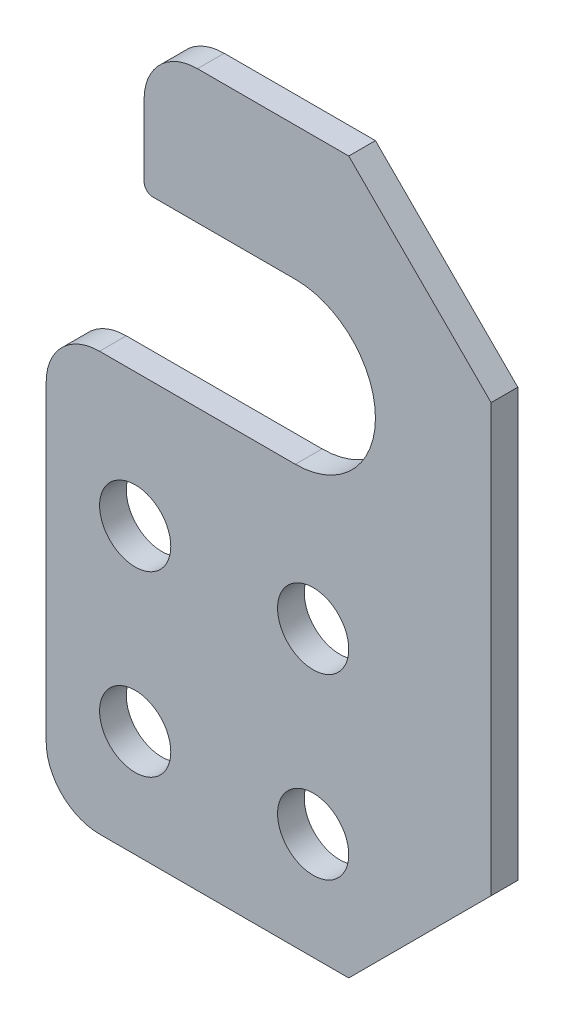
ISO-10303-21;
HEADER;
FILE_DESCRIPTION(('STEP AP214'),'2;1');
FILE_NAME('part.step','',(''),(''),'','','');
FILE_SCHEMA(('AUTOMOTIVE_DESIGN { 1 0 10303 214 1 1 1 1 }'));
ENDSEC;
DATA;
#1=APPLICATION_CONTEXT('core data for automotive mechanical design processes');
#2=APPLICATION_PROTOCOL_DEFINITION('international standard','automotive_design',2000,#1);
#3=PRODUCT_CONTEXT('',#1,'mechanical');
#4=PRODUCT('Part','Part','',(#3));
#5=PRODUCT_RELATED_PRODUCT_CATEGORY('part','',(#4));
#6=PRODUCT_DEFINITION_FORMATION('','',#4);
#7=PRODUCT_DEFINITION_CONTEXT('part definition',#1,'design');
#8=PRODUCT_DEFINITION('design','',#6,#7);
#9=PRODUCT_DEFINITION_SHAPE('','',#8);
#10=(LENGTH_UNIT() NAMED_UNIT(*) SI_UNIT(.MILLI.,.METRE.));
#11=(NAMED_UNIT(*) PLANE_ANGLE_UNIT() SI_UNIT($,.RADIAN.));
#12=(NAMED_UNIT(*) SI_UNIT($,.STERADIAN.) SOLID_ANGLE_UNIT());
#13=UNCERTAINTY_MEASURE_WITH_UNIT(LENGTH_MEASURE(1.E-05),#10,'distance_accuracy_value','');
#14=(GEOMETRIC_REPRESENTATION_CONTEXT(3) GLOBAL_UNCERTAINTY_ASSIGNED_CONTEXT((#13)) GLOBAL_UNIT_ASSIGNED_CONTEXT((#10,
#11,#12)) REPRESENTATION_CONTEXT('',''));
#15=CARTESIAN_POINT('',(0.,0.,0.));
#16=DIRECTION('',(0.,0.,1.));
#17=DIRECTION('',(1.,0.,0.));
#18=AXIS2_PLACEMENT_3D('',#15,#16,#17);
#19=CARTESIAN_POINT('',(0.,0.,1.5));
#20=DIRECTION('',(0.,0.,1.));
#21=DIRECTION('',(1.,0.,0.));
#22=AXIS2_PLACEMENT_3D('',#19,#20,#21);
#23=PLANE('',#22);
#24=DIRECTION('',(0.,1.,0.));
#25=VECTOR('',#24,1.);
#26=CARTESIAN_POINT('',(10.5,0.,1.5));
#27=LINE('',#26,#25);
#28=CARTESIAN_POINT('',(10.5,-7.,1.5));
#29=VERTEX_POINT('',#28);
#30=CARTESIAN_POINT('',(10.5,-3.,1.5));
#31=VERTEX_POINT('',#30);
#32=EDGE_CURVE('E152',#29,#31,#27,.T.);
#33=ORIENTED_EDGE('',*,*,#32,.F.);
#34=CARTESIAN_POINT('',(11.,-7.,1.5));
#35=DIRECTION('',(0.,0.,1.));
#36=DIRECTION('',(1.,0.,0.));
#37=AXIS2_PLACEMENT_3D('',#34,#35,#36);
#38=CIRCLE('',#37,0.5);
#39=CARTESIAN_POINT('',(11.,-7.5,1.5));
#40=VERTEX_POINT('',#39);
#41=EDGE_CURVE('E54',#29,#40,#38,.T.);
#42=ORIENTED_EDGE('',*,*,#41,.T.);
#43=DIRECTION('',(-1.,0.,0.));
#44=VECTOR('',#43,1.);
#45=CARTESIAN_POINT('',(10.5,-7.5,1.5));
#46=LINE('',#45,#44);
#47=CARTESIAN_POINT('',(19.,-7.5,1.5));
#48=VERTEX_POINT('',#47);
#49=EDGE_CURVE('E155',#48,#40,#46,.T.);
#50=ORIENTED_EDGE('',*,*,#49,.F.);
#51=CARTESIAN_POINT('',(19.,-12.,1.5));
#52=DIRECTION('',(0.,0.,1.));
#53=DIRECTION('',(1.,0.,0.));
#54=AXIS2_PLACEMENT_3D('',#51,#52,#53);
#55=CIRCLE('',#54,4.5);
#56=CARTESIAN_POINT('',(19.,-16.5,1.5));
#57=VERTEX_POINT('',#56);
#58=EDGE_CURVE('E141',#57,#48,#55,.T.);
#59=ORIENTED_EDGE('',*,*,#58,.F.);
#60=DIRECTION('',(1.,0.,0.));
#61=VECTOR('',#60,1.);
#62=CARTESIAN_POINT('',(5.,-16.5,1.5));
#63=LINE('',#62,#61);
#64=CARTESIAN_POINT('',(8.,-16.5,1.5));
#65=VERTEX_POINT('',#64);
#66=EDGE_CURVE('E133',#65,#57,#63,.T.);
#67=ORIENTED_EDGE('',*,*,#66,.F.);
#68=CARTESIAN_POINT('',(8.,-19.5,1.5));
#69=DIRECTION('',(0.,0.,1.));
#70=DIRECTION('',(1.,0.,0.));
#71=AXIS2_PLACEMENT_3D('',#68,#69,#70);
#72=CIRCLE('',#71,3.);
#73=CARTESIAN_POINT('',(5.,-19.5,1.5));
#74=VERTEX_POINT('',#73);
#75=EDGE_CURVE('E248',#65,#74,#72,.T.);
#76=ORIENTED_EDGE('',*,*,#75,.T.);
#77=DIRECTION('',(0.,1.,0.));
#78=VECTOR('',#77,1.);
#79=CARTESIAN_POINT('',(5.,-16.5,1.5));
#80=LINE('',#79,#78);
#81=CARTESIAN_POINT('',(5.,-37.,1.5));
#82=VERTEX_POINT('',#81);
#83=EDGE_CURVE('E142',#82,#74,#80,.T.);
#84=ORIENTED_EDGE('',*,*,#83,.F.);
#85=CARTESIAN_POINT('',(8.,-37.,1.5));
#86=DIRECTION('',(0.,0.,1.));
#87=DIRECTION('',(1.,0.,0.));
#88=AXIS2_PLACEMENT_3D('',#85,#86,#87);
#89=CIRCLE('',#88,3.);
#90=CARTESIAN_POINT('',(8.,-40.,1.5));
#91=VERTEX_POINT('',#90);
#92=EDGE_CURVE('E250',#82,#91,#89,.T.);
#93=ORIENTED_EDGE('',*,*,#92,.T.);
#94=DIRECTION('',(1.,0.,0.));
#95=VECTOR('',#94,1.);
#96=CARTESIAN_POINT('',(0.,-40.,1.5));
#97=LINE('',#96,#95);
#98=CARTESIAN_POINT('',(21.9999999999999,-40.,1.5));
#99=VERTEX_POINT('',#98);
#100=EDGE_CURVE('E192',#91,#99,#97,.T.);
#101=ORIENTED_EDGE('',*,*,#100,.T.);
#102=DIRECTION('',(-0.707106781186549,-0.707106781186546,0.));
#103=VECTOR('',#102,1.);
#104=CARTESIAN_POINT('',(30.9999999999999,-31.,1.5));
#105=LINE('',#104,#103);
#106=CARTESIAN_POINT('',(30.,-32.,1.5));
#107=VERTEX_POINT('',#106);
#108=EDGE_CURVE('E222',#99,#107,#105,.F.);
#109=ORIENTED_EDGE('',*,*,#108,.T.);
#110=DIRECTION('',(0.,1.,0.));
#111=VECTOR('',#110,1.);
#112=CARTESIAN_POINT('',(30.,0.,1.5));
#113=LINE('',#112,#111);
#114=CARTESIAN_POINT('',(30.,-8.00000000000002,1.5));
#115=VERTEX_POINT('',#114);
#116=EDGE_CURVE('E194',#107,#115,#113,.T.);
#117=ORIENTED_EDGE('',*,*,#116,.T.);
#118=DIRECTION('',(0.707106781186546,-0.707106781186549,0.));
#119=VECTOR('',#118,1.);
#120=CARTESIAN_POINT('',(11.,11.,1.5));
#121=LINE('',#120,#119);
#122=CARTESIAN_POINT('',(22.,0.,1.5));
#123=VERTEX_POINT('',#122);
#124=EDGE_CURVE('E220',#115,#123,#121,.F.);
#125=ORIENTED_EDGE('',*,*,#124,.T.);
#126=DIRECTION('',(-1.,0.,0.));
#127=VECTOR('',#126,1.);
#128=CARTESIAN_POINT('',(0.,0.,1.5));
#129=LINE('',#128,#127);
#130=CARTESIAN_POINT('',(13.5,0.,1.5));
#131=VERTEX_POINT('',#130);
#132=EDGE_CURVE('E198',#123,#131,#129,.T.);
#133=ORIENTED_EDGE('',*,*,#132,.T.);
#134=CARTESIAN_POINT('',(13.5,-3.,1.5));
#135=DIRECTION('',(0.,0.,1.));
#136=DIRECTION('',(1.,0.,0.));
#137=AXIS2_PLACEMENT_3D('',#134,#135,#136);
#138=CIRCLE('',#137,3.);
#139=EDGE_CURVE('E245',#131,#31,#138,.T.);
#140=ORIENTED_EDGE('',*,*,#139,.T.);
#141=EDGE_LOOP('',(#33,#42,#50,#59,#67,#76,#84,#93,#101,#109,#117,#125,#133,#140));
#142=FACE_BOUND('',#141,.T.);
#143=CARTESIAN_POINT('',(20.,-24.,1.5));
#144=DIRECTION('',(0.,0.,1.));
#145=DIRECTION('',(1.,0.,0.));
#146=AXIS2_PLACEMENT_3D('',#143,#144,#145);
#147=CIRCLE('',#146,2.);
#148=CARTESIAN_POINT('',(22.,-24.,1.5));
#149=VERTEX_POINT('',#148);
#150=EDGE_CURVE('E174',#149,#149,#147,.T.);
#151=ORIENTED_EDGE('',*,*,#150,.F.);
#152=EDGE_LOOP('',(#151));
#153=FACE_BOUND('',#152,.T.);
#154=CARTESIAN_POINT('',(20.,-34.,1.5));
#155=DIRECTION('',(0.,0.,1.));
#156=DIRECTION('',(1.,0.,0.));
#157=AXIS2_PLACEMENT_3D('',#154,#155,#156);
#158=CIRCLE('',#157,2.00000000000001);
#159=CARTESIAN_POINT('',(22.,-34.,1.5));
#160=VERTEX_POINT('',#159);
#161=EDGE_CURVE('E186',#160,#160,#158,.T.);
#162=ORIENTED_EDGE('',*,*,#161,.F.);
#163=EDGE_LOOP('',(#162));
#164=FACE_BOUND('',#163,.T.);
#165=CARTESIAN_POINT('',(10.,-34.,1.5));
#166=DIRECTION('',(0.,0.,1.));
#167=DIRECTION('',(1.,0.,0.));
#168=AXIS2_PLACEMENT_3D('',#165,#166,#167);
#169=CIRCLE('',#168,2.);
#170=CARTESIAN_POINT('',(12.,-34.,1.5));
#171=VERTEX_POINT('',#170);
#172=EDGE_CURVE('E180',#171,#171,#169,.T.);
#173=ORIENTED_EDGE('',*,*,#172,.F.);
#174=EDGE_LOOP('',(#173));
#175=FACE_BOUND('',#174,.T.);
#176=CARTESIAN_POINT('',(10.,-24.,1.5));
#177=DIRECTION('',(0.,0.,1.));
#178=DIRECTION('',(1.,0.,0.));
#179=AXIS2_PLACEMENT_3D('',#176,#177,#178);
#180=CIRCLE('',#179,2.);
#181=CARTESIAN_POINT('',(12.,-24.,1.5));
#182=VERTEX_POINT('',#181);
#183=EDGE_CURVE('E168',#182,#182,#180,.T.);
#184=ORIENTED_EDGE('',*,*,#183,.F.);
#185=EDGE_LOOP('',(#184));
#186=FACE_BOUND('',#185,.T.);
#187=ADVANCED_FACE('F32',(#142,#153,#164,#175,#186),#23,.T.);
#188=CARTESIAN_POINT('',(0.,0.,0.));
#189=DIRECTION('',(0.,0.,1.));
#190=DIRECTION('',(1.,0.,0.));
#191=AXIS2_PLACEMENT_3D('',#188,#189,#190);
#192=PLANE('',#191);
#193=DIRECTION('',(-1.,0.,0.));
#194=VECTOR('',#193,1.);
#195=CARTESIAN_POINT('',(0.,-7.5,0.));
#196=LINE('',#195,#194);
#197=CARTESIAN_POINT('',(19.,-7.5,0.));
#198=VERTEX_POINT('',#197);
#199=CARTESIAN_POINT('',(11.,-7.5,0.));
#200=VERTEX_POINT('',#199);
#201=EDGE_CURVE('E230',#198,#200,#196,.T.);
#202=ORIENTED_EDGE('',*,*,#201,.T.);
#203=CARTESIAN_POINT('',(11.,-7.,0.));
#204=DIRECTION('',(0.,0.,1.));
#205=DIRECTION('',(1.,0.,0.));
#206=AXIS2_PLACEMENT_3D('',#203,#204,#205);
#207=CIRCLE('',#206,0.5);
#208=CARTESIAN_POINT('',(10.5,-7.,0.));
#209=VERTEX_POINT('',#208);
#210=EDGE_CURVE('E11',#200,#209,#207,.F.);
#211=ORIENTED_EDGE('',*,*,#210,.T.);
#212=DIRECTION('',(0.,1.,0.));
#213=VECTOR('',#212,1.);
#214=CARTESIAN_POINT('',(10.5,0.,0.));
#215=LINE('',#214,#213);
#216=CARTESIAN_POINT('',(10.5,-3.,0.));
#217=VERTEX_POINT('',#216);
#218=EDGE_CURVE('E161',#209,#217,#215,.T.);
#219=ORIENTED_EDGE('',*,*,#218,.T.);
#220=CARTESIAN_POINT('',(13.5,-3.,0.));
#221=DIRECTION('',(0.,0.,1.));
#222=DIRECTION('',(1.,0.,0.));
#223=AXIS2_PLACEMENT_3D('',#220,#221,#222);
#224=CIRCLE('',#223,3.);
#225=CARTESIAN_POINT('',(13.5,0.,0.));
#226=VERTEX_POINT('',#225);
#227=EDGE_CURVE('E235',#217,#226,#224,.F.);
#228=ORIENTED_EDGE('',*,*,#227,.T.);
#229=DIRECTION('',(-1.,0.,0.));
#230=VECTOR('',#229,1.);
#231=CARTESIAN_POINT('',(0.,0.,0.));
#232=LINE('',#231,#230);
#233=CARTESIAN_POINT('',(22.,0.,0.));
#234=VERTEX_POINT('',#233);
#235=EDGE_CURVE('E195',#234,#226,#232,.T.);
#236=ORIENTED_EDGE('',*,*,#235,.F.);
#237=DIRECTION('',(-0.707106781186546,0.707106781186549,0.));
#238=VECTOR('',#237,1.);
#239=CARTESIAN_POINT('',(22.,0.,0.));
#240=LINE('',#239,#238);
#241=CARTESIAN_POINT('',(30.,-8.00000000000002,0.));
#242=VERTEX_POINT('',#241);
#243=EDGE_CURVE('E212',#234,#242,#240,.F.);
#244=ORIENTED_EDGE('',*,*,#243,.T.);
#245=DIRECTION('',(0.,1.,0.));
#246=VECTOR('',#245,1.);
#247=CARTESIAN_POINT('',(30.,0.,0.));
#248=LINE('',#247,#246);
#249=CARTESIAN_POINT('',(30.,-32.,0.));
#250=VERTEX_POINT('',#249);
#251=EDGE_CURVE('E203',#250,#242,#248,.T.);
#252=ORIENTED_EDGE('',*,*,#251,.F.);
#253=DIRECTION('',(0.707106781186549,0.707106781186546,0.));
#254=VECTOR('',#253,1.);
#255=CARTESIAN_POINT('',(30.,-32.,0.));
#256=LINE('',#255,#254);
#257=CARTESIAN_POINT('',(21.9999999999999,-40.,0.));
#258=VERTEX_POINT('',#257);
#259=EDGE_CURVE('E214',#250,#258,#256,.F.);
#260=ORIENTED_EDGE('',*,*,#259,.T.);
#261=DIRECTION('',(1.,0.,0.));
#262=VECTOR('',#261,1.);
#263=CARTESIAN_POINT('',(0.,-40.,0.));
#264=LINE('',#263,#262);
#265=CARTESIAN_POINT('',(8.,-40.,0.));
#266=VERTEX_POINT('',#265);
#267=EDGE_CURVE('E189',#266,#258,#264,.T.);
#268=ORIENTED_EDGE('',*,*,#267,.F.);
#269=CARTESIAN_POINT('',(8.,-37.,0.));
#270=DIRECTION('',(0.,0.,1.));
#271=DIRECTION('',(1.,0.,0.));
#272=AXIS2_PLACEMENT_3D('',#269,#270,#271);
#273=CIRCLE('',#272,3.);
#274=CARTESIAN_POINT('',(5.,-37.,0.));
#275=VERTEX_POINT('',#274);
#276=EDGE_CURVE('E239',#266,#275,#273,.F.);
#277=ORIENTED_EDGE('',*,*,#276,.T.);
#278=DIRECTION('',(0.,1.,0.));
#279=VECTOR('',#278,1.);
#280=CARTESIAN_POINT('',(5.,0.,0.));
#281=LINE('',#280,#279);
#282=CARTESIAN_POINT('',(5.,-19.5,0.));
#283=VERTEX_POINT('',#282);
#284=EDGE_CURVE('E164',#275,#283,#281,.T.);
#285=ORIENTED_EDGE('',*,*,#284,.T.);
#286=CARTESIAN_POINT('',(8.,-19.5,0.));
#287=DIRECTION('',(0.,0.,1.));
#288=DIRECTION('',(1.,0.,0.));
#289=AXIS2_PLACEMENT_3D('',#286,#287,#288);
#290=CIRCLE('',#289,3.);
#291=CARTESIAN_POINT('',(8.,-16.5,0.));
#292=VERTEX_POINT('',#291);
#293=EDGE_CURVE('E237',#283,#292,#290,.F.);
#294=ORIENTED_EDGE('',*,*,#293,.T.);
#295=DIRECTION('',(1.,0.,0.));
#296=VECTOR('',#295,1.);
#297=CARTESIAN_POINT('',(0.,-16.5,0.));
#298=LINE('',#297,#296);
#299=CARTESIAN_POINT('',(19.,-16.5,0.));
#300=VERTEX_POINT('',#299);
#301=EDGE_CURVE('E227',#292,#300,#298,.T.);
#302=ORIENTED_EDGE('',*,*,#301,.T.);
#303=CARTESIAN_POINT('',(19.,-12.,0.));
#304=DIRECTION('',(0.,0.,1.));
#305=DIRECTION('',(1.,0.,0.));
#306=AXIS2_PLACEMENT_3D('',#303,#304,#305);
#307=CIRCLE('',#306,4.5);
#308=EDGE_CURVE('E150',#300,#198,#307,.T.);
#309=ORIENTED_EDGE('',*,*,#308,.T.);
#310=EDGE_LOOP('',(#202,#211,#219,#228,#236,#244,#252,#260,#268,#277,#285,#294,#302,#309));
#311=FACE_BOUND('',#310,.T.);
#312=CARTESIAN_POINT('',(20.,-34.,0.));
#313=DIRECTION('',(0.,0.,1.));
#314=DIRECTION('',(1.,0.,0.));
#315=AXIS2_PLACEMENT_3D('',#312,#313,#314);
#316=CIRCLE('',#315,2.00000000000001);
#317=CARTESIAN_POINT('',(22.,-34.,0.));
#318=VERTEX_POINT('',#317);
#319=EDGE_CURVE('E183',#318,#318,#316,.T.);
#320=ORIENTED_EDGE('',*,*,#319,.T.);
#321=EDGE_LOOP('',(#320));
#322=FACE_BOUND('',#321,.T.);
#323=CARTESIAN_POINT('',(10.,-34.,0.));
#324=DIRECTION('',(0.,0.,1.));
#325=DIRECTION('',(1.,0.,0.));
#326=AXIS2_PLACEMENT_3D('',#323,#324,#325);
#327=CIRCLE('',#326,2.);
#328=CARTESIAN_POINT('',(12.,-34.,0.));
#329=VERTEX_POINT('',#328);
#330=EDGE_CURVE('E177',#329,#329,#327,.T.);
#331=ORIENTED_EDGE('',*,*,#330,.T.);
#332=EDGE_LOOP('',(#331));
#333=FACE_BOUND('',#332,.T.);
#334=CARTESIAN_POINT('',(20.,-24.,0.));
#335=DIRECTION('',(0.,0.,1.));
#336=DIRECTION('',(1.,0.,0.));
#337=AXIS2_PLACEMENT_3D('',#334,#335,#336);
#338=CIRCLE('',#337,2.);
#339=CARTESIAN_POINT('',(22.,-24.,0.));
#340=VERTEX_POINT('',#339);
#341=EDGE_CURVE('E171',#340,#340,#338,.T.);
#342=ORIENTED_EDGE('',*,*,#341,.T.);
#343=EDGE_LOOP('',(#342));
#344=FACE_BOUND('',#343,.T.);
#345=CARTESIAN_POINT('',(10.,-24.,0.));
#346=DIRECTION('',(0.,0.,1.));
#347=DIRECTION('',(1.,0.,0.));
#348=AXIS2_PLACEMENT_3D('',#345,#346,#347);
#349=CIRCLE('',#348,2.);
#350=CARTESIAN_POINT('',(12.,-24.,0.));
#351=VERTEX_POINT('',#350);
#352=EDGE_CURVE('E167',#351,#351,#349,.T.);
#353=ORIENTED_EDGE('',*,*,#352,.T.);
#354=EDGE_LOOP('',(#353));
#355=FACE_BOUND('',#354,.T.);
#356=ADVANCED_FACE('F276',(#311,#322,#333,#344,#355),#192,.F.);
#357=CARTESIAN_POINT('',(0.,-40.,1.5));
#358=DIRECTION('',(0.,1.,0.));
#359=DIRECTION('',(-1.,0.,0.));
#360=AXIS2_PLACEMENT_3D('',#357,#358,#359);
#361=PLANE('',#360);
#362=ORIENTED_EDGE('',*,*,#100,.F.);
#363=DIRECTION('',(0.,0.,-1.));
#364=VECTOR('',#363,1.);
#365=CARTESIAN_POINT('',(8.,-40.,1.5));
#366=LINE('',#365,#364);
#367=EDGE_CURVE('E232',#91,#266,#366,.T.);
#368=ORIENTED_EDGE('',*,*,#367,.T.);
#369=ORIENTED_EDGE('',*,*,#267,.T.);
#370=DIRECTION('',(0.,0.,1.));
#371=VECTOR('',#370,1.);
#372=CARTESIAN_POINT('',(22.,-40.,1.5));
#373=LINE('',#372,#371);
#374=EDGE_CURVE('E217',#258,#99,#373,.T.);
#375=ORIENTED_EDGE('',*,*,#374,.T.);
#376=EDGE_LOOP('',(#362,#368,#369,#375));
#377=FACE_BOUND('',#376,.T.);
#378=ADVANCED_FACE('F298',(#377),#361,.F.);
#379=CARTESIAN_POINT('',(30.,0.,1.5));
#380=DIRECTION('',(-1.,0.,0.));
#381=DIRECTION('',(0.,0.,1.));
#382=AXIS2_PLACEMENT_3D('',#379,#380,#381);
#383=PLANE('',#382);
#384=ORIENTED_EDGE('',*,*,#116,.F.);
#385=DIRECTION('',(0.,0.,-1.));
#386=VECTOR('',#385,1.);
#387=CARTESIAN_POINT('',(30.,-32.,1.5));
#388=LINE('',#387,#386);
#389=EDGE_CURVE('E209',#107,#250,#388,.T.);
#390=ORIENTED_EDGE('',*,*,#389,.T.);
#391=ORIENTED_EDGE('',*,*,#251,.T.);
#392=DIRECTION('',(0.,0.,1.));
#393=VECTOR('',#392,1.);
#394=CARTESIAN_POINT('',(30.,-8.00000000000002,1.5));
#395=LINE('',#394,#393);
#396=EDGE_CURVE('E201',#242,#115,#395,.T.);
#397=ORIENTED_EDGE('',*,*,#396,.T.);
#398=EDGE_LOOP('',(#384,#390,#391,#397));
#399=FACE_BOUND('',#398,.T.);
#400=ADVANCED_FACE('F288',(#399),#383,.F.);
#401=CARTESIAN_POINT('',(0.,0.,1.5));
#402=DIRECTION('',(0.,-1.,0.));
#403=DIRECTION('',(1.,0.,0.));
#404=AXIS2_PLACEMENT_3D('',#401,#402,#403);
#405=PLANE('',#404);
#406=ORIENTED_EDGE('',*,*,#235,.T.);
#407=DIRECTION('',(0.,0.,1.));
#408=VECTOR('',#407,1.);
#409=CARTESIAN_POINT('',(13.5,0.,1.5));
#410=LINE('',#409,#408);
#411=EDGE_CURVE('E253',#226,#131,#410,.T.);
#412=ORIENTED_EDGE('',*,*,#411,.T.);
#413=ORIENTED_EDGE('',*,*,#132,.F.);
#414=DIRECTION('',(0.,0.,-1.));
#415=VECTOR('',#414,1.);
#416=CARTESIAN_POINT('',(22.,0.,1.5));
#417=LINE('',#416,#415);
#418=EDGE_CURVE('E224',#123,#234,#417,.T.);
#419=ORIENTED_EDGE('',*,*,#418,.T.);
#420=EDGE_LOOP('',(#406,#412,#413,#419));
#421=FACE_BOUND('',#420,.T.);
#422=ADVANCED_FACE('F279',(#421),#405,.F.);
#423=CARTESIAN_POINT('',(20.,-34.,1.5));
#424=DIRECTION('',(0.,0.,-1.));
#425=DIRECTION('',(-1.,0.,0.));
#426=AXIS2_PLACEMENT_3D('',#423,#424,#425);
#427=CYLINDRICAL_SURFACE('',#426,2.00000000000001);
#428=ORIENTED_EDGE('',*,*,#161,.T.);
#429=EDGE_LOOP('',(#428));
#430=FACE_BOUND('',#429,.T.);
#431=ORIENTED_EDGE('',*,*,#319,.F.);
#432=EDGE_LOOP('',(#431));
#433=FACE_BOUND('',#432,.T.);
#434=ADVANCED_FACE('F323',(#430,#433),#427,.F.);
#435=CARTESIAN_POINT('',(10.,-34.,1.5));
#436=DIRECTION('',(0.,0.,-1.));
#437=DIRECTION('',(-1.,0.,0.));
#438=AXIS2_PLACEMENT_3D('',#435,#436,#437);
#439=CYLINDRICAL_SURFACE('',#438,2.);
#440=ORIENTED_EDGE('',*,*,#172,.T.);
#441=EDGE_LOOP('',(#440));
#442=FACE_BOUND('',#441,.T.);
#443=ORIENTED_EDGE('',*,*,#330,.F.);
#444=EDGE_LOOP('',(#443));
#445=FACE_BOUND('',#444,.T.);
#446=ADVANCED_FACE('F428',(#442,#445),#439,.F.);
#447=CARTESIAN_POINT('',(20.,-24.,1.5));
#448=DIRECTION('',(0.,0.,-1.));
#449=DIRECTION('',(-1.,0.,0.));
#450=AXIS2_PLACEMENT_3D('',#447,#448,#449);
#451=CYLINDRICAL_SURFACE('',#450,2.);
#452=ORIENTED_EDGE('',*,*,#150,.T.);
#453=EDGE_LOOP('',(#452));
#454=FACE_BOUND('',#453,.T.);
#455=ORIENTED_EDGE('',*,*,#341,.F.);
#456=EDGE_LOOP('',(#455));
#457=FACE_BOUND('',#456,.T.);
#458=ADVANCED_FACE('F434',(#454,#457),#451,.F.);
#459=CARTESIAN_POINT('',(10.,-24.,1.5));
#460=DIRECTION('',(0.,0.,-1.));
#461=DIRECTION('',(-1.,0.,0.));
#462=AXIS2_PLACEMENT_3D('',#459,#460,#461);
#463=CYLINDRICAL_SURFACE('',#462,2.);
#464=ORIENTED_EDGE('',*,*,#183,.T.);
#465=EDGE_LOOP('',(#464));
#466=FACE_BOUND('',#465,.T.);
#467=ORIENTED_EDGE('',*,*,#352,.F.);
#468=EDGE_LOOP('',(#467));
#469=FACE_BOUND('',#468,.T.);
#470=ADVANCED_FACE('F334',(#466,#469),#463,.F.);
#471=CARTESIAN_POINT('',(30.,-32.,1.5));
#472=DIRECTION('',(-0.707106781186546,0.707106781186549,0.));
#473=DIRECTION('',(0.,0.,-1.));
#474=AXIS2_PLACEMENT_3D('',#471,#472,#473);
#475=PLANE('',#474);
#476=ORIENTED_EDGE('',*,*,#108,.F.);
#477=ORIENTED_EDGE('',*,*,#374,.F.);
#478=ORIENTED_EDGE('',*,*,#259,.F.);
#479=ORIENTED_EDGE('',*,*,#389,.F.);
#480=EDGE_LOOP('',(#476,#477,#478,#479));
#481=FACE_BOUND('',#480,.T.);
#482=ADVANCED_FACE('F292',(#481),#475,.F.);
#483=CARTESIAN_POINT('',(22.,0.,1.5));
#484=DIRECTION('',(-0.707106781186549,-0.707106781186546,0.));
#485=DIRECTION('',(0.,0.,-1.));
#486=AXIS2_PLACEMENT_3D('',#483,#484,#485);
#487=PLANE('',#486);
#488=ORIENTED_EDGE('',*,*,#124,.F.);
#489=ORIENTED_EDGE('',*,*,#396,.F.);
#490=ORIENTED_EDGE('',*,*,#243,.F.);
#491=ORIENTED_EDGE('',*,*,#418,.F.);
#492=EDGE_LOOP('',(#488,#489,#490,#491));
#493=FACE_BOUND('',#492,.T.);
#494=ADVANCED_FACE('F283',(#493),#487,.F.);
#495=CARTESIAN_POINT('',(10.5,-7.5,-3.5));
#496=DIRECTION('',(0.,1.,0.));
#497=DIRECTION('',(-1.,0.,0.));
#498=AXIS2_PLACEMENT_3D('',#495,#496,#497);
#499=PLANE('',#498);
#500=ORIENTED_EDGE('',*,*,#49,.T.);
#501=DIRECTION('',(0.,0.,1.));
#502=VECTOR('',#501,1.);
#503=CARTESIAN_POINT('',(11.,-7.5,-3.5));
#504=LINE('',#503,#502);
#505=EDGE_CURVE('E40',#40,#200,#504,.F.);
#506=ORIENTED_EDGE('',*,*,#505,.T.);
#507=ORIENTED_EDGE('',*,*,#201,.F.);
#508=DIRECTION('',(0.,0.,1.));
#509=VECTOR('',#508,1.);
#510=CARTESIAN_POINT('',(19.,-7.5,-3.5));
#511=LINE('',#510,#509);
#512=EDGE_CURVE('E151',#198,#48,#511,.T.);
#513=ORIENTED_EDGE('',*,*,#512,.T.);
#514=EDGE_LOOP('',(#500,#506,#507,#513));
#515=FACE_BOUND('',#514,.T.);
#516=ADVANCED_FACE('F337',(#515),#499,.F.);
#517=CARTESIAN_POINT('',(19.,-12.,-3.5));
#518=DIRECTION('',(0.,0.,1.));
#519=DIRECTION('',(1.,0.,0.));
#520=AXIS2_PLACEMENT_3D('',#517,#518,#519);
#521=CYLINDRICAL_SURFACE('',#520,4.5);
#522=DIRECTION('',(0.,0.,1.));
#523=VECTOR('',#522,1.);
#524=CARTESIAN_POINT('',(19.,-16.5,-3.5));
#525=LINE('',#524,#523);
#526=EDGE_CURVE('E137',#300,#57,#525,.T.);
#527=ORIENTED_EDGE('',*,*,#526,.T.);
#528=ORIENTED_EDGE('',*,*,#58,.T.);
#529=ORIENTED_EDGE('',*,*,#512,.F.);
#530=ORIENTED_EDGE('',*,*,#308,.F.);
#531=EDGE_LOOP('',(#527,#528,#529,#530));
#532=FACE_BOUND('',#531,.T.);
#533=ADVANCED_FACE('F147',(#532),#521,.F.);
#534=CARTESIAN_POINT('',(5.,-16.5,-3.5));
#535=DIRECTION('',(0.,-1.,0.));
#536=DIRECTION('',(1.,0.,0.));
#537=AXIS2_PLACEMENT_3D('',#534,#535,#536);
#538=PLANE('',#537);
#539=ORIENTED_EDGE('',*,*,#301,.F.);
#540=DIRECTION('',(0.,0.,1.));
#541=VECTOR('',#540,1.);
#542=CARTESIAN_POINT('',(8.,-16.5,-3.5));
#543=LINE('',#542,#541);
#544=EDGE_CURVE('E139',#292,#65,#543,.T.);
#545=ORIENTED_EDGE('',*,*,#544,.T.);
#546=ORIENTED_EDGE('',*,*,#66,.T.);
#547=ORIENTED_EDGE('',*,*,#526,.F.);
#548=EDGE_LOOP('',(#539,#545,#546,#547));
#549=FACE_BOUND('',#548,.T.);
#550=ADVANCED_FACE('F136',(#549),#538,.F.);
#551=CARTESIAN_POINT('',(5.,-16.5,-3.5));
#552=DIRECTION('',(1.,0.,0.));
#553=DIRECTION('',(0.,1.,0.));
#554=AXIS2_PLACEMENT_3D('',#551,#552,#553);
#555=PLANE('',#554);
#556=ORIENTED_EDGE('',*,*,#284,.F.);
#557=DIRECTION('',(0.,0.,-1.));
#558=VECTOR('',#557,1.);
#559=CARTESIAN_POINT('',(5.,-37.,-3.5));
#560=LINE('',#559,#558);
#561=EDGE_CURVE('E243',#275,#82,#560,.F.);
#562=ORIENTED_EDGE('',*,*,#561,.T.);
#563=ORIENTED_EDGE('',*,*,#83,.T.);
#564=DIRECTION('',(0.,0.,1.));
#565=VECTOR('',#564,1.);
#566=CARTESIAN_POINT('',(5.,-19.5,-3.5));
#567=LINE('',#566,#565);
#568=EDGE_CURVE('E241',#74,#283,#567,.F.);
#569=ORIENTED_EDGE('',*,*,#568,.T.);
#570=EDGE_LOOP('',(#556,#562,#563,#569));
#571=FACE_BOUND('',#570,.T.);
#572=ADVANCED_FACE('F307',(#571),#555,.F.);
#573=CARTESIAN_POINT('',(10.5,0.,-3.5));
#574=DIRECTION('',(1.,0.,0.));
#575=DIRECTION('',(0.,0.,-1.));
#576=AXIS2_PLACEMENT_3D('',#573,#574,#575);
#577=PLANE('',#576);
#578=ORIENTED_EDGE('',*,*,#218,.F.);
#579=DIRECTION('',(0.,0.,1.));
#580=VECTOR('',#579,1.);
#581=CARTESIAN_POINT('',(10.5,-7.,-3.5));
#582=LINE('',#581,#580);
#583=EDGE_CURVE('E259',#209,#29,#582,.T.);
#584=ORIENTED_EDGE('',*,*,#583,.T.);
#585=ORIENTED_EDGE('',*,*,#32,.T.);
#586=DIRECTION('',(0.,0.,1.));
#587=VECTOR('',#586,1.);
#588=CARTESIAN_POINT('',(10.5,-3.,-3.5));
#589=LINE('',#588,#587);
#590=EDGE_CURVE('E256',#31,#217,#589,.F.);
#591=ORIENTED_EDGE('',*,*,#590,.T.);
#592=EDGE_LOOP('',(#578,#584,#585,#591));
#593=FACE_BOUND('',#592,.T.);
#594=ADVANCED_FACE('F265',(#593),#577,.F.);
#595=CARTESIAN_POINT('',(8.,-37.,1.5));
#596=DIRECTION('',(0.,0.,-1.));
#597=DIRECTION('',(-1.,0.,0.));
#598=AXIS2_PLACEMENT_3D('',#595,#596,#597);
#599=CYLINDRICAL_SURFACE('',#598,3.);
#600=ORIENTED_EDGE('',*,*,#92,.F.);
#601=ORIENTED_EDGE('',*,*,#561,.F.);
#602=ORIENTED_EDGE('',*,*,#276,.F.);
#603=ORIENTED_EDGE('',*,*,#367,.F.);
#604=EDGE_LOOP('',(#600,#601,#602,#603));
#605=FACE_BOUND('',#604,.T.);
#606=ADVANCED_FACE('F302',(#605),#599,.T.);
#607=CARTESIAN_POINT('',(8.,-19.5,-3.5));
#608=DIRECTION('',(0.,0.,1.));
#609=DIRECTION('',(1.,0.,0.));
#610=AXIS2_PLACEMENT_3D('',#607,#608,#609);
#611=CYLINDRICAL_SURFACE('',#610,3.);
#612=ORIENTED_EDGE('',*,*,#293,.F.);
#613=ORIENTED_EDGE('',*,*,#568,.F.);
#614=ORIENTED_EDGE('',*,*,#75,.F.);
#615=ORIENTED_EDGE('',*,*,#544,.F.);
#616=EDGE_LOOP('',(#612,#613,#614,#615));
#617=FACE_BOUND('',#616,.T.);
#618=ADVANCED_FACE('F311',(#617),#611,.T.);
#619=CARTESIAN_POINT('',(13.5,-3.,1.5));
#620=DIRECTION('',(0.,0.,1.));
#621=DIRECTION('',(1.,0.,0.));
#622=AXIS2_PLACEMENT_3D('',#619,#620,#621);
#623=CYLINDRICAL_SURFACE('',#622,3.);
#624=ORIENTED_EDGE('',*,*,#227,.F.);
#625=ORIENTED_EDGE('',*,*,#590,.F.);
#626=ORIENTED_EDGE('',*,*,#139,.F.);
#627=ORIENTED_EDGE('',*,*,#411,.F.);
#628=EDGE_LOOP('',(#624,#625,#626,#627));
#629=FACE_BOUND('',#628,.T.);
#630=ADVANCED_FACE('F273',(#629),#623,.T.);
#631=CARTESIAN_POINT('',(11.,-7.,-3.5));
#632=DIRECTION('',(0.,0.,1.));
#633=DIRECTION('',(1.,0.,0.));
#634=AXIS2_PLACEMENT_3D('',#631,#632,#633);
#635=CYLINDRICAL_SURFACE('',#634,0.5);
#636=ORIENTED_EDGE('',*,*,#210,.F.);
#637=ORIENTED_EDGE('',*,*,#505,.F.);
#638=ORIENTED_EDGE('',*,*,#41,.F.);
#639=ORIENTED_EDGE('',*,*,#583,.F.);
#640=EDGE_LOOP('',(#636,#637,#638,#639));
#641=FACE_BOUND('',#640,.T.);
#642=ADVANCED_FACE('F34',(#641),#635,.T.);
#643=CLOSED_SHELL('',(#187,#356,#378,#400,#422,#434,#446,#458,#470,#482,#494,#516,#533,#550,
#572,#594,#606,#618,#630,#642));
#644=MANIFOLD_SOLID_BREP('B2',#643);
#645=ADVANCED_BREP_SHAPE_REPRESENTATION('',(#18,#644),#14);
#646=SHAPE_DEFINITION_REPRESENTATION(#9,#645);
ENDSEC;
END-ISO-10303-21;
